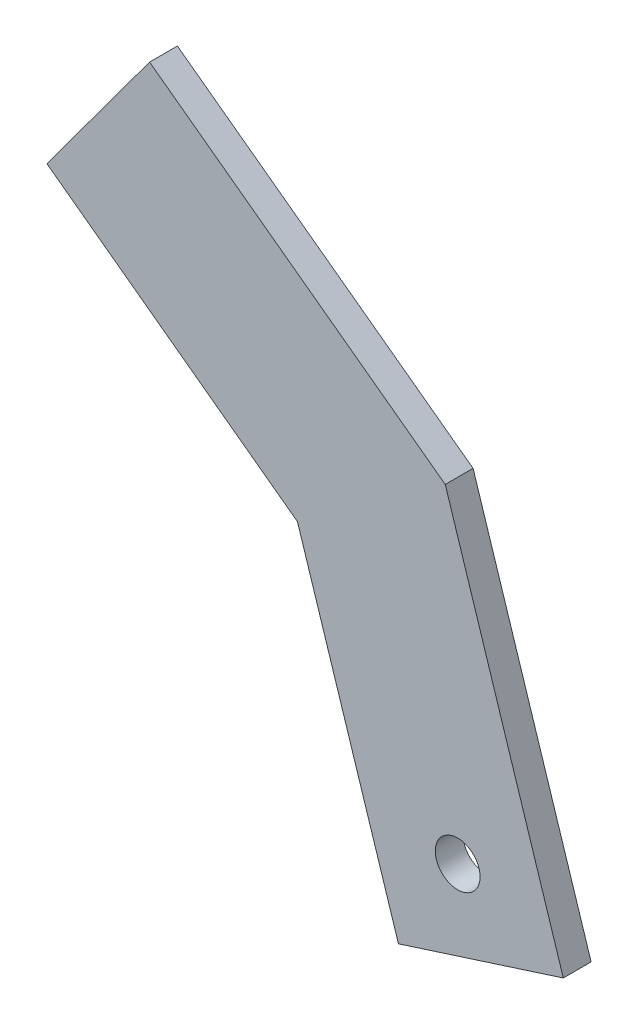
ISO-10303-21;
HEADER;
FILE_DESCRIPTION(('STEP AP214'),'2;1');
FILE_NAME('part.step','',(''),(''),'','','');
FILE_SCHEMA(('AUTOMOTIVE_DESIGN { 1 0 10303 214 1 1 1 1 }'));
ENDSEC;
DATA;
#1=APPLICATION_CONTEXT('core data for automotive mechanical design processes');
#2=APPLICATION_PROTOCOL_DEFINITION('international standard','automotive_design',2000,#1);
#3=PRODUCT_CONTEXT('',#1,'mechanical');
#4=PRODUCT('Part','Part','',(#3));
#5=PRODUCT_RELATED_PRODUCT_CATEGORY('part','',(#4));
#6=PRODUCT_DEFINITION_FORMATION('','',#4);
#7=PRODUCT_DEFINITION_CONTEXT('part definition',#1,'design');
#8=PRODUCT_DEFINITION('design','',#6,#7);
#9=PRODUCT_DEFINITION_SHAPE('','',#8);
#10=(LENGTH_UNIT() NAMED_UNIT(*) SI_UNIT(.MILLI.,.METRE.));
#11=(NAMED_UNIT(*) PLANE_ANGLE_UNIT() SI_UNIT($,.RADIAN.));
#12=(NAMED_UNIT(*) SI_UNIT($,.STERADIAN.) SOLID_ANGLE_UNIT());
#13=UNCERTAINTY_MEASURE_WITH_UNIT(LENGTH_MEASURE(1.E-05),#10,'distance_accuracy_value','');
#14=(GEOMETRIC_REPRESENTATION_CONTEXT(3) GLOBAL_UNCERTAINTY_ASSIGNED_CONTEXT((#13)) GLOBAL_UNIT_ASSIGNED_CONTEXT((#10,
#11,#12)) REPRESENTATION_CONTEXT('',''));
#15=CARTESIAN_POINT('',(0.,0.,0.));
#16=DIRECTION('',(0.,0.,1.));
#17=DIRECTION('',(1.,0.,0.));
#18=AXIS2_PLACEMENT_3D('',#15,#16,#17);
#19=CARTESIAN_POINT('',(0.,0.,20.));
#20=DIRECTION('',(0.,0.,-1.));
#21=DIRECTION('',(-1.,0.,0.));
#22=AXIS2_PLACEMENT_3D('',#19,#20,#21);
#23=PLANE('',#22);
#24=DIRECTION('',(0.305140279786784,-0.9523074134184,0.));
#25=VECTOR('',#24,1.);
#26=CARTESIAN_POINT('',(-8.92658695792698,231.720060769977,20.));
#27=LINE('',#26,#25);
#28=CARTESIAN_POINT('',(-8.92658695792698,231.720060769977,20.));
#29=VERTEX_POINT('',#28);
#30=CARTESIAN_POINT('',(75.9127530881895,-33.0536771707992,20.));
#31=VERTEX_POINT('',#30);
#32=EDGE_CURVE('E173',#29,#31,#27,.T.);
#33=ORIENTED_EDGE('',*,*,#32,.F.);
#34=DIRECTION('',(-0.804985308096528,0.593294744413548,0.));
#35=VECTOR('',#34,1.);
#36=CARTESIAN_POINT('',(-8.92658695792698,231.720060769977,20.));
#37=LINE('',#36,#35);
#38=CARTESIAN_POINT('',(-221.409823018865,388.325636005918,20.));
#39=VERTEX_POINT('',#38);
#40=EDGE_CURVE('E127',#29,#39,#37,.T.);
#41=ORIENTED_EDGE('',*,*,#40,.T.);
#42=DIRECTION('',(-0.593294744413548,-0.804985308096528,0.));
#43=VECTOR('',#42,1.);
#44=CARTESIAN_POINT('',(-221.409823018865,388.325636005918,20.));
#45=LINE('',#44,#43);
#46=CARTESIAN_POINT('',(-295.223128237015,288.175370388128,20.));
#47=VERTEX_POINT('',#46);
#48=EDGE_CURVE('E119',#39,#47,#45,.T.);
#49=ORIENTED_EDGE('',*,*,#48,.T.);
#50=DIRECTION('',(0.804985308096529,-0.593294744413548,0.));
#51=VECTOR('',#50,1.);
#52=CARTESIAN_POINT('',(-295.223128237015,288.175370388128,20.));
#53=LINE('',#52,#51);
#54=CARTESIAN_POINT('',(-115.128312507459,155.440888660594,20.));
#55=VERTEX_POINT('',#54);
#56=EDGE_CURVE('E125',#47,#55,#53,.T.);
#57=ORIENTED_EDGE('',*,*,#56,.T.);
#58=DIRECTION('',(-0.305140279786784,0.9523074134184,0.));
#59=VECTOR('',#58,1.);
#60=CARTESIAN_POINT('',(-42.5662296266188,-71.0169539709624,20.));
#61=LINE('',#60,#59);
#62=CARTESIAN_POINT('',(-42.5662296266188,-71.0169539709624,20.));
#63=VERTEX_POINT('',#62);
#64=EDGE_CURVE('E145',#63,#55,#61,.T.);
#65=ORIENTED_EDGE('',*,*,#64,.F.);
#66=DIRECTION('',(-0.9523074134184,-0.305140279786784,0.));
#67=VECTOR('',#66,1.);
#68=CARTESIAN_POINT('',(75.9127530881895,-33.0536771707992,20.));
#69=LINE('',#68,#67);
#70=EDGE_CURVE('E148',#31,#63,#69,.T.);
#71=ORIENTED_EDGE('',*,*,#70,.F.);
#72=EDGE_LOOP('',(#33,#41,#49,#57,#65,#71));
#73=FACE_BOUND('',#72,.T.);
#74=CARTESIAN_POINT('',(0.,0.,20.));
#75=DIRECTION('',(0.,0.,1.));
#76=DIRECTION('',(1.,0.,0.));
#77=AXIS2_PLACEMENT_3D('',#74,#75,#76);
#78=CIRCLE('',#77,16.1026199511082);
#79=CARTESIAN_POINT('',(16.1026199511082,0.,20.));
#80=VERTEX_POINT('',#79);
#81=EDGE_CURVE('E159',#80,#80,#78,.T.);
#82=ORIENTED_EDGE('',*,*,#81,.F.);
#83=EDGE_LOOP('',(#82));
#84=FACE_BOUND('',#83,.T.);
#85=ADVANCED_FACE('F60',(#73,#84),#23,.F.);
#86=CARTESIAN_POINT('',(0.,0.,0.));
#87=DIRECTION('',(0.,0.,-1.));
#88=DIRECTION('',(-1.,0.,0.));
#89=AXIS2_PLACEMENT_3D('',#86,#87,#88);
#90=PLANE('',#89);
#91=DIRECTION('',(0.305140279786784,-0.9523074134184,0.));
#92=VECTOR('',#91,1.);
#93=CARTESIAN_POINT('',(-8.92658695792698,231.720060769977,0.));
#94=LINE('',#93,#92);
#95=CARTESIAN_POINT('',(-8.92658695792698,231.720060769977,0.));
#96=VERTEX_POINT('',#95);
#97=CARTESIAN_POINT('',(75.9127530881895,-33.0536771707992,0.));
#98=VERTEX_POINT('',#97);
#99=EDGE_CURVE('E154',#96,#98,#94,.T.);
#100=ORIENTED_EDGE('',*,*,#99,.T.);
#101=DIRECTION('',(-0.9523074134184,-0.305140279786784,0.));
#102=VECTOR('',#101,1.);
#103=CARTESIAN_POINT('',(75.9127530881895,-33.0536771707992,0.));
#104=LINE('',#103,#102);
#105=CARTESIAN_POINT('',(-42.5662296266188,-71.0169539709624,0.));
#106=VERTEX_POINT('',#105);
#107=EDGE_CURVE('E158',#98,#106,#104,.T.);
#108=ORIENTED_EDGE('',*,*,#107,.T.);
#109=DIRECTION('',(-0.305140279786784,0.9523074134184,0.));
#110=VECTOR('',#109,1.);
#111=CARTESIAN_POINT('',(-42.5662296266188,-71.0169539709624,0.));
#112=LINE('',#111,#110);
#113=CARTESIAN_POINT('',(-115.128312507459,155.440888660594,0.));
#114=VERTEX_POINT('',#113);
#115=EDGE_CURVE('E163',#106,#114,#112,.T.);
#116=ORIENTED_EDGE('',*,*,#115,.T.);
#117=DIRECTION('',(0.804985308096529,-0.593294744413548,0.));
#118=VECTOR('',#117,1.);
#119=CARTESIAN_POINT('',(-295.223128237015,288.175370388128,0.));
#120=LINE('',#119,#118);
#121=CARTESIAN_POINT('',(-295.223128237015,288.175370388128,0.));
#122=VERTEX_POINT('',#121);
#123=EDGE_CURVE('E167',#122,#114,#120,.T.);
#124=ORIENTED_EDGE('',*,*,#123,.F.);
#125=DIRECTION('',(-0.593294744413548,-0.804985308096528,0.));
#126=VECTOR('',#125,1.);
#127=CARTESIAN_POINT('',(-221.409823018865,388.325636005918,0.));
#128=LINE('',#127,#126);
#129=CARTESIAN_POINT('',(-221.409823018865,388.325636005918,0.));
#130=VERTEX_POINT('',#129);
#131=EDGE_CURVE('E135',#130,#122,#128,.T.);
#132=ORIENTED_EDGE('',*,*,#131,.F.);
#133=DIRECTION('',(-0.804985308096528,0.593294744413548,0.));
#134=VECTOR('',#133,1.);
#135=CARTESIAN_POINT('',(-8.92658695792698,231.720060769977,0.));
#136=LINE('',#135,#134);
#137=EDGE_CURVE('E101',#96,#130,#136,.T.);
#138=ORIENTED_EDGE('',*,*,#137,.F.);
#139=EDGE_LOOP('',(#100,#108,#116,#124,#132,#138));
#140=FACE_BOUND('',#139,.T.);
#141=CARTESIAN_POINT('',(0.,0.,0.));
#142=DIRECTION('',(0.,0.,1.));
#143=DIRECTION('',(1.,0.,0.));
#144=AXIS2_PLACEMENT_3D('',#141,#142,#143);
#145=CIRCLE('',#144,16.1026199511082);
#146=CARTESIAN_POINT('',(16.1026199511082,0.,0.));
#147=VERTEX_POINT('',#146);
#148=EDGE_CURVE('E192',#147,#147,#145,.T.);
#149=ORIENTED_EDGE('',*,*,#148,.T.);
#150=EDGE_LOOP('',(#149));
#151=FACE_BOUND('',#150,.T.);
#152=ADVANCED_FACE('F184',(#140,#151),#90,.T.);
#153=CARTESIAN_POINT('',(-8.92658695792698,231.720060769977,20.));
#154=DIRECTION('',(0.9523074134184,0.305140279786784,0.));
#155=DIRECTION('',(-0.305140279786784,0.9523074134184,0.));
#156=AXIS2_PLACEMENT_3D('',#153,#154,#155);
#157=PLANE('',#156);
#158=ORIENTED_EDGE('',*,*,#99,.F.);
#159=DIRECTION('',(0.,0.,-1.));
#160=VECTOR('',#159,1.);
#161=CARTESIAN_POINT('',(-8.92658695792698,231.720060769977,20.));
#162=LINE('',#161,#160);
#163=EDGE_CURVE('E12',#29,#96,#162,.T.);
#164=ORIENTED_EDGE('',*,*,#163,.F.);
#165=ORIENTED_EDGE('',*,*,#32,.T.);
#166=DIRECTION('',(0.,0.,-1.));
#167=VECTOR('',#166,1.);
#168=CARTESIAN_POINT('',(75.9127530881895,-33.0536771707992,20.));
#169=LINE('',#168,#167);
#170=EDGE_CURVE('E64',#31,#98,#169,.T.);
#171=ORIENTED_EDGE('',*,*,#170,.T.);
#172=EDGE_LOOP('',(#158,#164,#165,#171));
#173=FACE_BOUND('',#172,.T.);
#174=ADVANCED_FACE('F62',(#173),#157,.T.);
#175=CARTESIAN_POINT('',(-8.92658695792698,231.720060769977,20.));
#176=DIRECTION('',(-0.593294744413548,-0.804985308096528,0.));
#177=DIRECTION('',(0.804985308096528,-0.593294744413548,0.));
#178=AXIS2_PLACEMENT_3D('',#175,#176,#177);
#179=PLANE('',#178);
#180=ORIENTED_EDGE('',*,*,#137,.T.);
#181=DIRECTION('',(0.,0.,-1.));
#182=VECTOR('',#181,1.);
#183=CARTESIAN_POINT('',(-221.409823018865,388.325636005918,20.));
#184=LINE('',#183,#182);
#185=EDGE_CURVE('E71',#39,#130,#184,.T.);
#186=ORIENTED_EDGE('',*,*,#185,.F.);
#187=ORIENTED_EDGE('',*,*,#40,.F.);
#188=ORIENTED_EDGE('',*,*,#163,.T.);
#189=EDGE_LOOP('',(#180,#186,#187,#188));
#190=FACE_BOUND('',#189,.T.);
#191=ADVANCED_FACE('F210',(#190),#179,.F.);
#192=CARTESIAN_POINT('',(-221.409823018865,388.325636005918,20.));
#193=DIRECTION('',(0.804985308096528,-0.593294744413548,0.));
#194=DIRECTION('',(0.593294744413548,0.804985308096529,0.));
#195=AXIS2_PLACEMENT_3D('',#192,#193,#194);
#196=PLANE('',#195);
#197=ORIENTED_EDGE('',*,*,#131,.T.);
#198=DIRECTION('',(0.,0.,-1.));
#199=VECTOR('',#198,1.);
#200=CARTESIAN_POINT('',(-295.223128237015,288.175370388128,20.));
#201=LINE('',#200,#199);
#202=EDGE_CURVE('E132',#47,#122,#201,.T.);
#203=ORIENTED_EDGE('',*,*,#202,.F.);
#204=ORIENTED_EDGE('',*,*,#48,.F.);
#205=ORIENTED_EDGE('',*,*,#185,.T.);
#206=EDGE_LOOP('',(#197,#203,#204,#205));
#207=FACE_BOUND('',#206,.T.);
#208=ADVANCED_FACE('F133',(#207),#196,.F.);
#209=CARTESIAN_POINT('',(-295.223128237015,288.175370388128,20.));
#210=DIRECTION('',(0.593294744413548,0.804985308096529,0.));
#211=DIRECTION('',(-0.804985308096529,0.593294744413548,0.));
#212=AXIS2_PLACEMENT_3D('',#209,#210,#211);
#213=PLANE('',#212);
#214=ORIENTED_EDGE('',*,*,#123,.T.);
#215=DIRECTION('',(0.,0.,-1.));
#216=VECTOR('',#215,1.);
#217=CARTESIAN_POINT('',(-115.128312507459,155.440888660594,20.));
#218=LINE('',#217,#216);
#219=EDGE_CURVE('E140',#55,#114,#218,.T.);
#220=ORIENTED_EDGE('',*,*,#219,.F.);
#221=ORIENTED_EDGE('',*,*,#56,.F.);
#222=ORIENTED_EDGE('',*,*,#202,.T.);
#223=EDGE_LOOP('',(#214,#220,#221,#222));
#224=FACE_BOUND('',#223,.T.);
#225=ADVANCED_FACE('F142',(#224),#213,.F.);
#226=CARTESIAN_POINT('',(-42.5662296266188,-71.0169539709624,20.));
#227=DIRECTION('',(-0.9523074134184,-0.305140279786784,0.));
#228=DIRECTION('',(0.305140279786784,-0.9523074134184,0.));
#229=AXIS2_PLACEMENT_3D('',#226,#227,#228);
#230=PLANE('',#229);
#231=ORIENTED_EDGE('',*,*,#115,.F.);
#232=DIRECTION('',(0.,0.,-1.));
#233=VECTOR('',#232,1.);
#234=CARTESIAN_POINT('',(-42.5662296266188,-71.0169539709624,20.));
#235=LINE('',#234,#233);
#236=EDGE_CURVE('E178',#63,#106,#235,.T.);
#237=ORIENTED_EDGE('',*,*,#236,.F.);
#238=ORIENTED_EDGE('',*,*,#64,.T.);
#239=ORIENTED_EDGE('',*,*,#219,.T.);
#240=EDGE_LOOP('',(#231,#237,#238,#239));
#241=FACE_BOUND('',#240,.T.);
#242=ADVANCED_FACE('F187',(#241),#230,.T.);
#243=CARTESIAN_POINT('',(75.9127530881895,-33.0536771707992,20.));
#244=DIRECTION('',(0.305140279786784,-0.9523074134184,0.));
#245=DIRECTION('',(0.9523074134184,0.305140279786784,0.));
#246=AXIS2_PLACEMENT_3D('',#243,#244,#245);
#247=PLANE('',#246);
#248=ORIENTED_EDGE('',*,*,#107,.F.);
#249=ORIENTED_EDGE('',*,*,#170,.F.);
#250=ORIENTED_EDGE('',*,*,#70,.T.);
#251=ORIENTED_EDGE('',*,*,#236,.T.);
#252=EDGE_LOOP('',(#248,#249,#250,#251));
#253=FACE_BOUND('',#252,.T.);
#254=ADVANCED_FACE('F182',(#253),#247,.T.);
#255=CARTESIAN_POINT('',(0.,0.,20.));
#256=DIRECTION('',(0.,0.,-1.));
#257=DIRECTION('',(-1.,0.,0.));
#258=AXIS2_PLACEMENT_3D('',#255,#256,#257);
#259=CYLINDRICAL_SURFACE('',#258,16.1026199511082);
#260=ORIENTED_EDGE('',*,*,#81,.T.);
#261=EDGE_LOOP('',(#260));
#262=FACE_BOUND('',#261,.T.);
#263=ORIENTED_EDGE('',*,*,#148,.F.);
#264=EDGE_LOOP('',(#263));
#265=FACE_BOUND('',#264,.T.);
#266=ADVANCED_FACE('F200',(#262,#265),#259,.F.);
#267=CLOSED_SHELL('',(#85,#152,#174,#191,#208,#225,#242,#254,#266));
#268=MANIFOLD_SOLID_BREP('B2',#267);
#269=ADVANCED_BREP_SHAPE_REPRESENTATION('',(#18,#268),#14);
#270=SHAPE_DEFINITION_REPRESENTATION(#9,#269);
ENDSEC;
END-ISO-10303-21;
